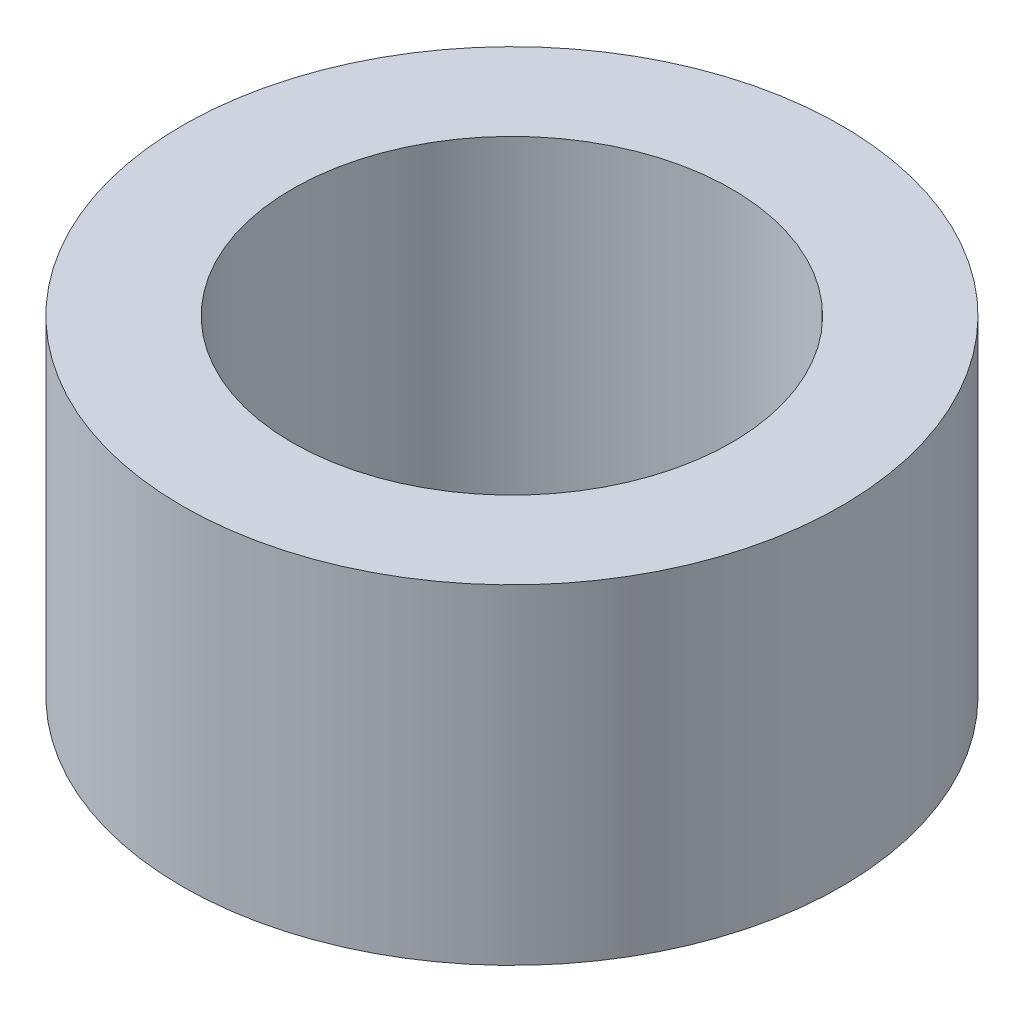
ISO-10303-21;
HEADER;
FILE_DESCRIPTION(('STEP AP214'),'2;1');
FILE_NAME('part.step','',(''),(''),'','','');
FILE_SCHEMA(('AUTOMOTIVE_DESIGN { 1 0 10303 214 1 1 1 1 }'));
ENDSEC;
DATA;
#1=APPLICATION_CONTEXT('core data for automotive mechanical design processes');
#2=APPLICATION_PROTOCOL_DEFINITION('international standard','automotive_design',2000,#1);
#3=PRODUCT_CONTEXT('',#1,'mechanical');
#4=PRODUCT('Part','Part','',(#3));
#5=PRODUCT_RELATED_PRODUCT_CATEGORY('part','',(#4));
#6=PRODUCT_DEFINITION_FORMATION('','',#4);
#7=PRODUCT_DEFINITION_CONTEXT('part definition',#1,'design');
#8=PRODUCT_DEFINITION('design','',#6,#7);
#9=PRODUCT_DEFINITION_SHAPE('','',#8);
#10=(LENGTH_UNIT() NAMED_UNIT(*) SI_UNIT(.MILLI.,.METRE.));
#11=(NAMED_UNIT(*) PLANE_ANGLE_UNIT() SI_UNIT($,.RADIAN.));
#12=(NAMED_UNIT(*) SI_UNIT($,.STERADIAN.) SOLID_ANGLE_UNIT());
#13=UNCERTAINTY_MEASURE_WITH_UNIT(LENGTH_MEASURE(1.E-05),#10,'distance_accuracy_value','');
#14=(GEOMETRIC_REPRESENTATION_CONTEXT(3) GLOBAL_UNCERTAINTY_ASSIGNED_CONTEXT((#13)) GLOBAL_UNIT_ASSIGNED_CONTEXT((#10,
#11,#12)) REPRESENTATION_CONTEXT('',''));
#15=CARTESIAN_POINT('',(0.,0.,0.));
#16=DIRECTION('',(0.,0.,1.));
#17=DIRECTION('',(1.,0.,0.));
#18=AXIS2_PLACEMENT_3D('',#15,#16,#17);
#19=CARTESIAN_POINT('',(0.,3.,0.));
#20=DIRECTION('',(0.,1.,0.));
#21=DIRECTION('',(0.,0.,1.));
#22=AXIS2_PLACEMENT_3D('',#19,#20,#21);
#23=PLANE('',#22);
#24=CARTESIAN_POINT('',(0.,3.,0.));
#25=DIRECTION('',(0.,1.,0.));
#26=DIRECTION('',(0.,0.,1.));
#27=AXIS2_PLACEMENT_3D('',#24,#25,#26);
#28=CIRCLE('',#27,3.);
#29=CARTESIAN_POINT('',(0.,3.,3.));
#30=VERTEX_POINT('',#29);
#31=EDGE_CURVE('E10',#30,#30,#28,.T.);
#32=ORIENTED_EDGE('',*,*,#31,.T.);
#33=EDGE_LOOP('',(#32));
#34=FACE_BOUND('',#33,.T.);
#35=CARTESIAN_POINT('',(0.,3.,0.));
#36=DIRECTION('',(0.,1.,0.));
#37=DIRECTION('',(0.,0.,1.));
#38=AXIS2_PLACEMENT_3D('',#35,#36,#37);
#39=CIRCLE('',#38,2.);
#40=CARTESIAN_POINT('',(0.,3.,2.));
#41=VERTEX_POINT('',#40);
#42=EDGE_CURVE('E42',#41,#41,#39,.T.);
#43=ORIENTED_EDGE('',*,*,#42,.F.);
#44=EDGE_LOOP('',(#43));
#45=FACE_BOUND('',#44,.T.);
#46=ADVANCED_FACE('F31',(#34,#45),#23,.T.);
#47=CARTESIAN_POINT('',(0.,0.,0.));
#48=DIRECTION('',(0.,1.,0.));
#49=DIRECTION('',(0.,0.,1.));
#50=AXIS2_PLACEMENT_3D('',#47,#48,#49);
#51=PLANE('',#50);
#52=CARTESIAN_POINT('',(0.,0.,0.));
#53=DIRECTION('',(0.,1.,0.));
#54=DIRECTION('',(0.,0.,1.));
#55=AXIS2_PLACEMENT_3D('',#52,#53,#54);
#56=CIRCLE('',#55,3.);
#57=CARTESIAN_POINT('',(0.,0.,3.));
#58=VERTEX_POINT('',#57);
#59=EDGE_CURVE('E35',#58,#58,#56,.T.);
#60=ORIENTED_EDGE('',*,*,#59,.F.);
#61=EDGE_LOOP('',(#60));
#62=FACE_BOUND('',#61,.T.);
#63=CARTESIAN_POINT('',(0.,0.,0.));
#64=DIRECTION('',(0.,1.,0.));
#65=DIRECTION('',(0.,0.,1.));
#66=AXIS2_PLACEMENT_3D('',#63,#64,#65);
#67=CIRCLE('',#66,2.);
#68=CARTESIAN_POINT('',(0.,0.,2.));
#69=VERTEX_POINT('',#68);
#70=EDGE_CURVE('E44',#69,#69,#67,.T.);
#71=ORIENTED_EDGE('',*,*,#70,.T.);
#72=EDGE_LOOP('',(#71));
#73=FACE_BOUND('',#72,.T.);
#74=ADVANCED_FACE('F54',(#62,#73),#51,.F.);
#75=CARTESIAN_POINT('',(0.,3.,0.));
#76=DIRECTION('',(0.,-1.,0.));
#77=DIRECTION('',(0.,0.,-1.));
#78=AXIS2_PLACEMENT_3D('',#75,#76,#77);
#79=CYLINDRICAL_SURFACE('',#78,3.);
#80=ORIENTED_EDGE('',*,*,#31,.F.);
#81=EDGE_LOOP('',(#80));
#82=FACE_BOUND('',#81,.T.);
#83=ORIENTED_EDGE('',*,*,#59,.T.);
#84=EDGE_LOOP('',(#83));
#85=FACE_BOUND('',#84,.T.);
#86=ADVANCED_FACE('F33',(#82,#85),#79,.T.);
#87=CARTESIAN_POINT('',(0.,3.,0.));
#88=DIRECTION('',(0.,-1.,0.));
#89=DIRECTION('',(0.,0.,-1.));
#90=AXIS2_PLACEMENT_3D('',#87,#88,#89);
#91=CYLINDRICAL_SURFACE('',#90,2.);
#92=ORIENTED_EDGE('',*,*,#42,.T.);
#93=EDGE_LOOP('',(#92));
#94=FACE_BOUND('',#93,.T.);
#95=ORIENTED_EDGE('',*,*,#70,.F.);
#96=EDGE_LOOP('',(#95));
#97=FACE_BOUND('',#96,.T.);
#98=ADVANCED_FACE('F50',(#94,#97),#91,.F.);
#99=CLOSED_SHELL('',(#46,#74,#86,#98));
#100=MANIFOLD_SOLID_BREP('B2',#99);
#101=ADVANCED_BREP_SHAPE_REPRESENTATION('',(#18,#100),#14);
#102=SHAPE_DEFINITION_REPRESENTATION(#9,#101);
ENDSEC;
END-ISO-10303-21;
